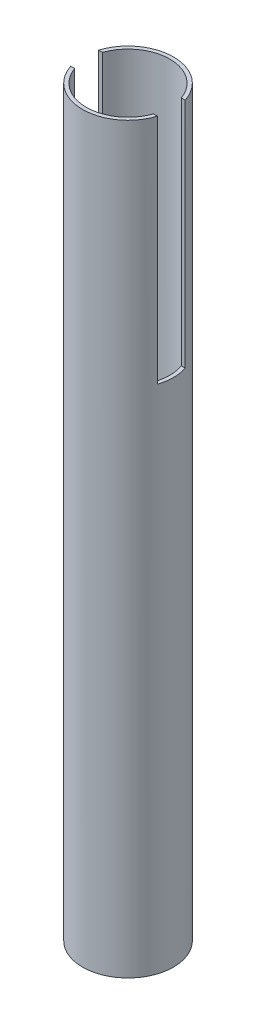
ISO-10303-21;
HEADER;
FILE_DESCRIPTION(('STEP AP214'),'2;1');
FILE_NAME('part.step','',(''),(''),'','','');
FILE_SCHEMA(('AUTOMOTIVE_DESIGN { 1 0 10303 214 1 1 1 1 }'));
ENDSEC;
DATA;
#1=APPLICATION_CONTEXT('core data for automotive mechanical design processes');
#2=APPLICATION_PROTOCOL_DEFINITION('international standard','automotive_design',2000,#1);
#3=PRODUCT_CONTEXT('',#1,'mechanical');
#4=PRODUCT('Part','Part','',(#3));
#5=PRODUCT_RELATED_PRODUCT_CATEGORY('part','',(#4));
#6=PRODUCT_DEFINITION_FORMATION('','',#4);
#7=PRODUCT_DEFINITION_CONTEXT('part definition',#1,'design');
#8=PRODUCT_DEFINITION('design','',#6,#7);
#9=PRODUCT_DEFINITION_SHAPE('','',#8);
#10=(LENGTH_UNIT() NAMED_UNIT(*) SI_UNIT(.MILLI.,.METRE.));
#11=(NAMED_UNIT(*) PLANE_ANGLE_UNIT() SI_UNIT($,.RADIAN.));
#12=(NAMED_UNIT(*) SI_UNIT($,.STERADIAN.) SOLID_ANGLE_UNIT());
#13=UNCERTAINTY_MEASURE_WITH_UNIT(LENGTH_MEASURE(1.E-05),#10,'distance_accuracy_value','');
#14=(GEOMETRIC_REPRESENTATION_CONTEXT(3) GLOBAL_UNCERTAINTY_ASSIGNED_CONTEXT((#13)) GLOBAL_UNIT_ASSIGNED_CONTEXT((#10,
#11,#12)) REPRESENTATION_CONTEXT('',''));
#15=CARTESIAN_POINT('',(0.,0.,0.));
#16=DIRECTION('',(0.,0.,1.));
#17=DIRECTION('',(1.,0.,0.));
#18=AXIS2_PLACEMENT_3D('',#15,#16,#17);
#19=CARTESIAN_POINT('',(0.,400.,0.));
#20=DIRECTION('',(0.,1.,0.));
#21=DIRECTION('',(0.,0.,1.));
#22=AXIS2_PLACEMENT_3D('',#19,#20,#21);
#23=PLANE('',#22);
#24=DIRECTION('',(1.,0.,0.));
#25=VECTOR('',#24,1.);
#26=CARTESIAN_POINT('',(31.5,400.,7.5));
#27=LINE('',#26,#25);
#28=CARTESIAN_POINT('',(-23.3238075793812,400.,7.5));
#29=VERTEX_POINT('',#28);
#30=CARTESIAN_POINT('',(-21.2132034355964,400.,7.5));
#31=VERTEX_POINT('',#30);
#32=EDGE_CURVE('E173',#29,#31,#27,.T.);
#33=ORIENTED_EDGE('',*,*,#32,.F.);
#34=CARTESIAN_POINT('',(0.,400.,0.));
#35=DIRECTION('',(0.,1.,0.));
#36=DIRECTION('',(0.,0.,1.));
#37=AXIS2_PLACEMENT_3D('',#34,#35,#36);
#38=CIRCLE('',#37,24.5);
#39=CARTESIAN_POINT('',(23.3238075793812,400.,7.5));
#40=VERTEX_POINT('',#39);
#41=EDGE_CURVE('E137',#29,#40,#38,.T.);
#42=ORIENTED_EDGE('',*,*,#41,.T.);
#43=CARTESIAN_POINT('',(21.2132034355964,400.,7.5));
#44=VERTEX_POINT('',#43);
#45=EDGE_CURVE('E130',#44,#40,#27,.T.);
#46=ORIENTED_EDGE('',*,*,#45,.F.);
#47=CARTESIAN_POINT('',(0.,400.,0.));
#48=DIRECTION('',(0.,1.,0.));
#49=DIRECTION('',(0.,0.,1.));
#50=AXIS2_PLACEMENT_3D('',#47,#48,#49);
#51=CIRCLE('',#50,22.5);
#52=EDGE_CURVE('E180',#31,#44,#51,.T.);
#53=ORIENTED_EDGE('',*,*,#52,.F.);
#54=EDGE_LOOP('',(#33,#42,#46,#53));
#55=FACE_BOUND('',#54,.T.);
#56=ADVANCED_FACE('F48',(#55),#23,.T.);
#57=DIRECTION('',(-1.,0.,0.));
#58=VECTOR('',#57,1.);
#59=CARTESIAN_POINT('',(31.5,400.,-7.5));
#60=LINE('',#59,#58);
#61=CARTESIAN_POINT('',(23.3238075793812,400.,-7.5));
#62=VERTEX_POINT('',#61);
#63=CARTESIAN_POINT('',(21.2132034355964,400.,-7.5));
#64=VERTEX_POINT('',#63);
#65=EDGE_CURVE('E114',#62,#64,#60,.T.);
#66=ORIENTED_EDGE('',*,*,#65,.F.);
#67=CARTESIAN_POINT('',(-23.3238075793812,400.,-7.5));
#68=VERTEX_POINT('',#67);
#69=EDGE_CURVE('E127',#62,#68,#38,.T.);
#70=ORIENTED_EDGE('',*,*,#69,.T.);
#71=CARTESIAN_POINT('',(-21.2132034355964,400.,-7.5));
#72=VERTEX_POINT('',#71);
#73=EDGE_CURVE('E131',#72,#68,#60,.T.);
#74=ORIENTED_EDGE('',*,*,#73,.F.);
#75=EDGE_CURVE('E129',#64,#72,#51,.T.);
#76=ORIENTED_EDGE('',*,*,#75,.F.);
#77=EDGE_LOOP('',(#66,#70,#74,#76));
#78=FACE_BOUND('',#77,.T.);
#79=ADVANCED_FACE('F125',(#78),#23,.T.);
#80=CARTESIAN_POINT('',(0.,0.,0.));
#81=DIRECTION('',(0.,1.,0.));
#82=DIRECTION('',(0.,0.,1.));
#83=AXIS2_PLACEMENT_3D('',#80,#81,#82);
#84=PLANE('',#83);
#85=CARTESIAN_POINT('',(0.,0.,0.));
#86=DIRECTION('',(0.,1.,0.));
#87=DIRECTION('',(0.,0.,1.));
#88=AXIS2_PLACEMENT_3D('',#85,#86,#87);
#89=CIRCLE('',#88,24.5);
#90=CARTESIAN_POINT('',(0.,0.,24.5));
#91=VERTEX_POINT('',#90);
#92=EDGE_CURVE('E144',#91,#91,#89,.T.);
#93=ORIENTED_EDGE('',*,*,#92,.F.);
#94=EDGE_LOOP('',(#93));
#95=FACE_BOUND('',#94,.T.);
#96=CARTESIAN_POINT('',(0.,0.,0.));
#97=DIRECTION('',(0.,1.,0.));
#98=DIRECTION('',(0.,0.,1.));
#99=AXIS2_PLACEMENT_3D('',#96,#97,#98);
#100=CIRCLE('',#99,22.5);
#101=CARTESIAN_POINT('',(0.,0.,22.5));
#102=VERTEX_POINT('',#101);
#103=EDGE_CURVE('E147',#102,#102,#100,.T.);
#104=ORIENTED_EDGE('',*,*,#103,.T.);
#105=EDGE_LOOP('',(#104));
#106=FACE_BOUND('',#105,.T.);
#107=ADVANCED_FACE('F186',(#95,#106),#84,.F.);
#108=CARTESIAN_POINT('',(0.,400.,0.));
#109=DIRECTION('',(0.,-1.,0.));
#110=DIRECTION('',(0.,0.,-1.));
#111=AXIS2_PLACEMENT_3D('',#108,#109,#110);
#112=CYLINDRICAL_SURFACE('',#111,24.5);
#113=CARTESIAN_POINT('',(0.,275.,0.));
#114=DIRECTION('',(0.,1.,0.));
#115=DIRECTION('',(0.,0.,1.));
#116=AXIS2_PLACEMENT_3D('',#113,#114,#115);
#117=CIRCLE('',#116,24.5);
#118=CARTESIAN_POINT('',(23.3238075793812,275.,7.5));
#119=VERTEX_POINT('',#118);
#120=CARTESIAN_POINT('',(23.3238075793812,275.,-7.5));
#121=VERTEX_POINT('',#120);
#122=EDGE_CURVE('E175',#119,#121,#117,.T.);
#123=ORIENTED_EDGE('',*,*,#122,.F.);
#124=DIRECTION('',(0.,-1.,0.));
#125=VECTOR('',#124,1.);
#126=CARTESIAN_POINT('',(23.3238075793812,400.,7.5));
#127=LINE('',#126,#125);
#128=EDGE_CURVE('E119',#119,#40,#127,.F.);
#129=ORIENTED_EDGE('',*,*,#128,.T.);
#130=ORIENTED_EDGE('',*,*,#41,.F.);
#131=DIRECTION('',(0.,-1.,0.));
#132=VECTOR('',#131,1.);
#133=CARTESIAN_POINT('',(-23.3238075793812,400.,7.5));
#134=LINE('',#133,#132);
#135=CARTESIAN_POINT('',(-23.3238075793812,275.,7.5));
#136=VERTEX_POINT('',#135);
#137=EDGE_CURVE('E178',#29,#136,#134,.T.);
#138=ORIENTED_EDGE('',*,*,#137,.T.);
#139=CARTESIAN_POINT('',(-23.3238075793812,275.,-7.5));
#140=VERTEX_POINT('',#139);
#141=EDGE_CURVE('E168',#140,#136,#117,.T.);
#142=ORIENTED_EDGE('',*,*,#141,.F.);
#143=DIRECTION('',(0.,-1.,0.));
#144=VECTOR('',#143,1.);
#145=CARTESIAN_POINT('',(-23.3238075793812,400.,-7.5));
#146=LINE('',#145,#144);
#147=EDGE_CURVE('E120',#140,#68,#146,.F.);
#148=ORIENTED_EDGE('',*,*,#147,.T.);
#149=ORIENTED_EDGE('',*,*,#69,.F.);
#150=DIRECTION('',(0.,-1.,0.));
#151=VECTOR('',#150,1.);
#152=CARTESIAN_POINT('',(23.3238075793812,400.,-7.5));
#153=LINE('',#152,#151);
#154=EDGE_CURVE('E111',#62,#121,#153,.T.);
#155=ORIENTED_EDGE('',*,*,#154,.T.);
#156=EDGE_LOOP('',(#123,#129,#130,#138,#142,#148,#149,#155));
#157=FACE_BOUND('',#156,.T.);
#158=ORIENTED_EDGE('',*,*,#92,.T.);
#159=EDGE_LOOP('',(#158));
#160=FACE_BOUND('',#159,.T.);
#161=ADVANCED_FACE('F50',(#157,#160),#112,.T.);
#162=CARTESIAN_POINT('',(0.,400.,0.));
#163=DIRECTION('',(0.,-1.,0.));
#164=DIRECTION('',(0.,0.,-1.));
#165=AXIS2_PLACEMENT_3D('',#162,#163,#164);
#166=CYLINDRICAL_SURFACE('',#165,22.5);
#167=DIRECTION('',(0.,-1.,0.));
#168=VECTOR('',#167,1.);
#169=CARTESIAN_POINT('',(21.2132034355964,400.,7.5));
#170=LINE('',#169,#168);
#171=CARTESIAN_POINT('',(21.2132034355964,275.,7.5));
#172=VERTEX_POINT('',#171);
#173=EDGE_CURVE('E13',#172,#44,#170,.F.);
#174=ORIENTED_EDGE('',*,*,#173,.F.);
#175=CARTESIAN_POINT('',(0.,275.,0.));
#176=DIRECTION('',(0.,1.,0.));
#177=DIRECTION('',(0.,0.,1.));
#178=AXIS2_PLACEMENT_3D('',#175,#176,#177);
#179=CIRCLE('',#178,22.5);
#180=CARTESIAN_POINT('',(21.2132034355964,275.,-7.5));
#181=VERTEX_POINT('',#180);
#182=EDGE_CURVE('E142',#172,#181,#179,.T.);
#183=ORIENTED_EDGE('',*,*,#182,.T.);
#184=DIRECTION('',(0.,-1.,0.));
#185=VECTOR('',#184,1.);
#186=CARTESIAN_POINT('',(21.2132034355964,400.,-7.5));
#187=LINE('',#186,#185);
#188=EDGE_CURVE('E56',#64,#181,#187,.T.);
#189=ORIENTED_EDGE('',*,*,#188,.F.);
#190=ORIENTED_EDGE('',*,*,#75,.T.);
#191=DIRECTION('',(0.,-1.,0.));
#192=VECTOR('',#191,1.);
#193=CARTESIAN_POINT('',(-21.2132034355964,400.,-7.5));
#194=LINE('',#193,#192);
#195=CARTESIAN_POINT('',(-21.2132034355964,275.,-7.5));
#196=VERTEX_POINT('',#195);
#197=EDGE_CURVE('E140',#196,#72,#194,.F.);
#198=ORIENTED_EDGE('',*,*,#197,.F.);
#199=CARTESIAN_POINT('',(-21.2132034355964,275.,7.5));
#200=VERTEX_POINT('',#199);
#201=EDGE_CURVE('E136',#196,#200,#179,.T.);
#202=ORIENTED_EDGE('',*,*,#201,.T.);
#203=DIRECTION('',(0.,-1.,0.));
#204=VECTOR('',#203,1.);
#205=CARTESIAN_POINT('',(-21.2132034355964,400.,7.5));
#206=LINE('',#205,#204);
#207=EDGE_CURVE('E152',#31,#200,#206,.T.);
#208=ORIENTED_EDGE('',*,*,#207,.F.);
#209=ORIENTED_EDGE('',*,*,#52,.T.);
#210=EDGE_LOOP('',(#174,#183,#189,#190,#198,#202,#208,#209));
#211=FACE_BOUND('',#210,.T.);
#212=ORIENTED_EDGE('',*,*,#103,.F.);
#213=EDGE_LOOP('',(#212));
#214=FACE_BOUND('',#213,.T.);
#215=ADVANCED_FACE('F156',(#211,#214),#166,.F.);
#216=CARTESIAN_POINT('',(0.,275.,0.));
#217=DIRECTION('',(0.,1.,0.));
#218=DIRECTION('',(0.,0.,1.));
#219=AXIS2_PLACEMENT_3D('',#216,#217,#218);
#220=PLANE('',#219);
#221=ORIENTED_EDGE('',*,*,#141,.T.);
#222=DIRECTION('',(1.,0.,0.));
#223=VECTOR('',#222,1.);
#224=CARTESIAN_POINT('',(31.5,275.,7.5));
#225=LINE('',#224,#223);
#226=EDGE_CURVE('E71',#136,#200,#225,.T.);
#227=ORIENTED_EDGE('',*,*,#226,.T.);
#228=ORIENTED_EDGE('',*,*,#201,.F.);
#229=DIRECTION('',(-1.,0.,0.));
#230=VECTOR('',#229,1.);
#231=CARTESIAN_POINT('',(31.5,275.,-7.5));
#232=LINE('',#231,#230);
#233=EDGE_CURVE('E169',#196,#140,#232,.T.);
#234=ORIENTED_EDGE('',*,*,#233,.T.);
#235=EDGE_LOOP('',(#221,#227,#228,#234));
#236=FACE_BOUND('',#235,.T.);
#237=ADVANCED_FACE('F188',(#236),#220,.T.);
#238=CARTESIAN_POINT('',(31.5,275.,-7.5));
#239=DIRECTION('',(0.,0.,-1.));
#240=DIRECTION('',(-1.,0.,0.));
#241=AXIS2_PLACEMENT_3D('',#238,#239,#240);
#242=PLANE('',#241);
#243=ORIENTED_EDGE('',*,*,#233,.F.);
#244=ORIENTED_EDGE('',*,*,#197,.T.);
#245=ORIENTED_EDGE('',*,*,#73,.T.);
#246=ORIENTED_EDGE('',*,*,#147,.F.);
#247=EDGE_LOOP('',(#243,#244,#245,#246));
#248=FACE_BOUND('',#247,.T.);
#249=ADVANCED_FACE('F194',(#248),#242,.F.);
#250=CARTESIAN_POINT('',(31.5,275.,7.5));
#251=DIRECTION('',(0.,0.,1.));
#252=DIRECTION('',(1.,0.,0.));
#253=AXIS2_PLACEMENT_3D('',#250,#251,#252);
#254=PLANE('',#253);
#255=ORIENTED_EDGE('',*,*,#32,.T.);
#256=ORIENTED_EDGE('',*,*,#207,.T.);
#257=ORIENTED_EDGE('',*,*,#226,.F.);
#258=ORIENTED_EDGE('',*,*,#137,.F.);
#259=EDGE_LOOP('',(#255,#256,#257,#258));
#260=FACE_BOUND('',#259,.T.);
#261=ADVANCED_FACE('F237',(#260),#254,.F.);
#262=EDGE_CURVE('E162',#172,#119,#225,.T.);
#263=ORIENTED_EDGE('',*,*,#262,.F.);
#264=ORIENTED_EDGE('',*,*,#173,.T.);
#265=ORIENTED_EDGE('',*,*,#45,.T.);
#266=ORIENTED_EDGE('',*,*,#128,.F.);
#267=EDGE_LOOP('',(#263,#264,#265,#266));
#268=FACE_BOUND('',#267,.T.);
#269=ADVANCED_FACE('F164',(#268),#254,.F.);
#270=ORIENTED_EDGE('',*,*,#65,.T.);
#271=ORIENTED_EDGE('',*,*,#188,.T.);
#272=EDGE_CURVE('E63',#121,#181,#232,.T.);
#273=ORIENTED_EDGE('',*,*,#272,.F.);
#274=ORIENTED_EDGE('',*,*,#154,.F.);
#275=EDGE_LOOP('',(#270,#271,#273,#274));
#276=FACE_BOUND('',#275,.T.);
#277=ADVANCED_FACE('F113',(#276),#242,.F.);
#278=ORIENTED_EDGE('',*,*,#122,.T.);
#279=ORIENTED_EDGE('',*,*,#272,.T.);
#280=ORIENTED_EDGE('',*,*,#182,.F.);
#281=ORIENTED_EDGE('',*,*,#262,.T.);
#282=EDGE_LOOP('',(#278,#279,#280,#281));
#283=FACE_BOUND('',#282,.T.);
#284=ADVANCED_FACE('F161',(#283),#220,.T.);
#285=CLOSED_SHELL('',(#56,#79,#107,#161,#215,#237,#249,#261,#269,#277,#284));
#286=MANIFOLD_SOLID_BREP('B2',#285);
#287=CARTESIAN_POINT('',(0.,245.,0.));
#288=DIRECTION('',(0.,-1.,0.));
#289=DIRECTION('',(0.,0.,-1.));
#290=AXIS2_PLACEMENT_3D('',#287,#288,#289);
#291=CYLINDRICAL_SURFACE('',#290,21.);
#292=CARTESIAN_POINT('',(0.,245.,0.));
#293=DIRECTION('',(0.,1.,0.));
#294=DIRECTION('',(0.,0.,1.));
#295=AXIS2_PLACEMENT_3D('',#292,#293,#294);
#296=CIRCLE('',#295,21.);
#297=CARTESIAN_POINT('',(0.,245.,21.));
#298=VERTEX_POINT('',#297);
#299=EDGE_CURVE('E47',#298,#298,#296,.T.);
#300=ORIENTED_EDGE('',*,*,#299,.F.);
#301=EDGE_LOOP('',(#300));
#302=FACE_BOUND('',#301,.T.);
#303=CARTESIAN_POINT('',(0.,0.,0.));
#304=DIRECTION('',(0.,1.,0.));
#305=DIRECTION('',(0.,0.,1.));
#306=AXIS2_PLACEMENT_3D('',#303,#304,#305);
#307=CIRCLE('',#306,21.);
#308=CARTESIAN_POINT('',(0.,0.,21.));
#309=VERTEX_POINT('',#308);
#310=EDGE_CURVE('E287',#309,#309,#307,.T.);
#311=ORIENTED_EDGE('',*,*,#310,.T.);
#312=EDGE_LOOP('',(#311));
#313=FACE_BOUND('',#312,.T.);
#314=ADVANCED_FACE('F284',(#302,#313),#291,.T.);
#315=CARTESIAN_POINT('',(0.,245.,0.));
#316=DIRECTION('',(0.,1.,0.));
#317=DIRECTION('',(0.,0.,1.));
#318=AXIS2_PLACEMENT_3D('',#315,#316,#317);
#319=PLANE('',#318);
#320=ORIENTED_EDGE('',*,*,#299,.T.);
#321=EDGE_LOOP('',(#320));
#322=FACE_BOUND('',#321,.T.);
#323=ADVANCED_FACE('F299',(#322),#319,.T.);
#324=CARTESIAN_POINT('',(0.,0.,0.));
#325=DIRECTION('',(0.,1.,0.));
#326=DIRECTION('',(0.,0.,1.));
#327=AXIS2_PLACEMENT_3D('',#324,#325,#326);
#328=PLANE('',#327);
#329=ORIENTED_EDGE('',*,*,#310,.F.);
#330=EDGE_LOOP('',(#329));
#331=FACE_BOUND('',#330,.T.);
#332=ADVANCED_FACE('F297',(#331),#328,.F.);
#333=CLOSED_SHELL('',(#314,#323,#332));
#334=MANIFOLD_SOLID_BREP('B7',#333);
#335=ADVANCED_BREP_SHAPE_REPRESENTATION('',(#18,#286,#334),#14);
#336=SHAPE_DEFINITION_REPRESENTATION(#9,#335);
ENDSEC;
END-ISO-10303-21;
